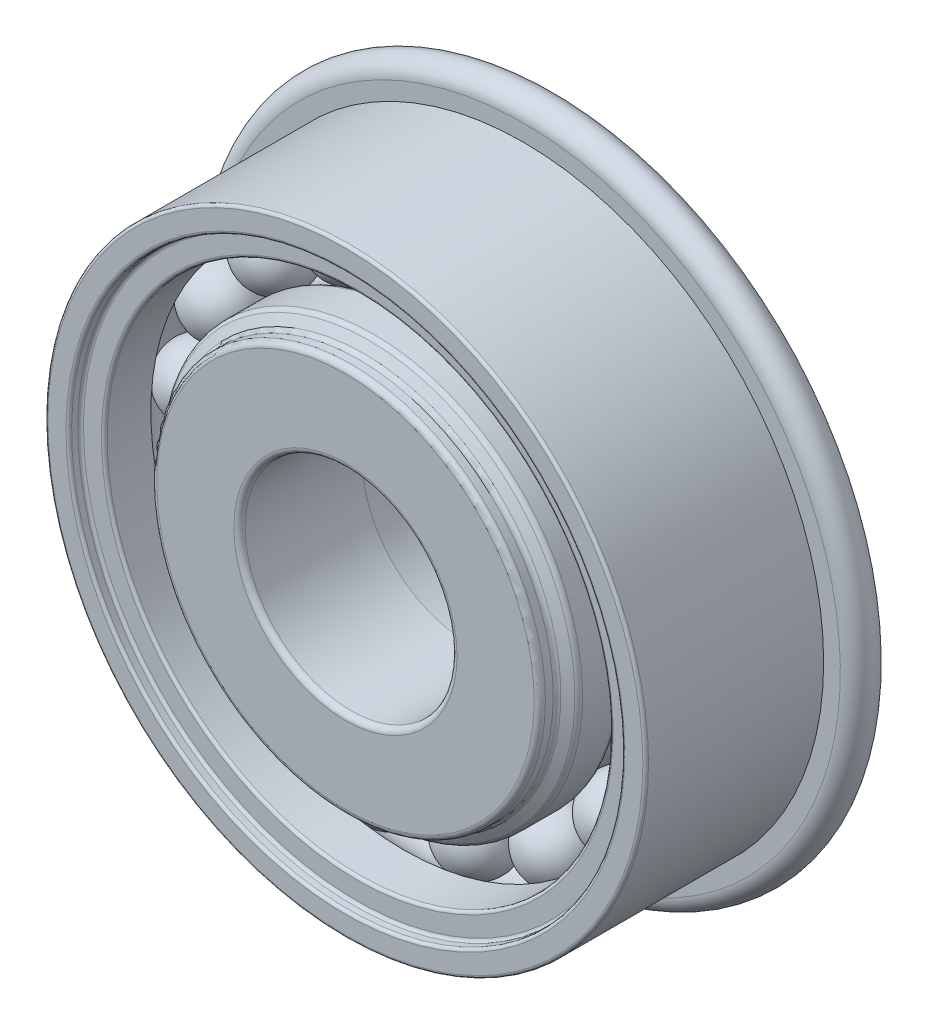
ISO-10303-21;
HEADER;
FILE_DESCRIPTION(('STEP AP214'),'2;1');
FILE_NAME('part.step','',(''),(''),'','','');
FILE_SCHEMA(('AUTOMOTIVE_DESIGN { 1 0 10303 214 1 1 1 1 }'));
ENDSEC;
DATA;
#1=APPLICATION_CONTEXT('core data for automotive mechanical design processes');
#2=APPLICATION_PROTOCOL_DEFINITION('international standard','automotive_design',2000,#1);
#3=PRODUCT_CONTEXT('',#1,'mechanical');
#4=PRODUCT('Part','Part','',(#3));
#5=PRODUCT_RELATED_PRODUCT_CATEGORY('part','',(#4));
#6=PRODUCT_DEFINITION_FORMATION('','',#4);
#7=PRODUCT_DEFINITION_CONTEXT('part definition',#1,'design');
#8=PRODUCT_DEFINITION('design','',#6,#7);
#9=PRODUCT_DEFINITION_SHAPE('','',#8);
#10=(LENGTH_UNIT() NAMED_UNIT(*) SI_UNIT(.MILLI.,.METRE.));
#11=(NAMED_UNIT(*) PLANE_ANGLE_UNIT() SI_UNIT($,.RADIAN.));
#12=(NAMED_UNIT(*) SI_UNIT($,.STERADIAN.) SOLID_ANGLE_UNIT());
#13=UNCERTAINTY_MEASURE_WITH_UNIT(LENGTH_MEASURE(1.E-05),#10,'distance_accuracy_value','');
#14=(GEOMETRIC_REPRESENTATION_CONTEXT(3) GLOBAL_UNCERTAINTY_ASSIGNED_CONTEXT((#13)) GLOBAL_UNIT_ASSIGNED_CONTEXT((#10,
#11,#12)) REPRESENTATION_CONTEXT('',''));
#15=CARTESIAN_POINT('',(0.,0.,0.));
#16=DIRECTION('',(0.,0.,1.));
#17=DIRECTION('',(1.,0.,0.));
#18=AXIS2_PLACEMENT_3D('',#15,#16,#17);
#19=CARTESIAN_POINT('',(-3.82161171076038,9.86471696209167,1.5621));
#20=DIRECTION('',(-0.361241666187141,0.932472229404361,0.));
#21=DIRECTION('',(0.,0.,-1.));
#22=AXIS2_PLACEMENT_3D('',#19,#20,#21);
#23=SPHERICAL_SURFACE('',#22,1.5875);
#24=CARTESIAN_POINT('',(-4.39508285583246,11.3450166262711,1.5621));
#25=VERTEX_POINT('',#24);
#26=VERTEX_LOOP('',#25);
#27=FACE_BOUND('',#26,.T.);
#28=ADVANCED_FACE('F46',(#27),#23,.T.);
#29=CLOSED_SHELL('',(#28));
#30=MANIFOLD_SOLID_BREP('B2',#29);
#31=CARTESIAN_POINT('',(-7.1270935837012,7.81804923616916,1.5621));
#32=DIRECTION('',(-0.673695643646548,0.739008917220668,0.));
#33=DIRECTION('',(0.,0.,-1.));
#34=AXIS2_PLACEMENT_3D('',#31,#32,#33);
#35=SPHERICAL_SURFACE('',#34,1.5875);
#36=CARTESIAN_POINT('',(-8.19658541799009,8.99122589225697,1.5621));
#37=VERTEX_POINT('',#36);
#38=VERTEX_LOOP('',#37);
#39=FACE_BOUND('',#38,.T.);
#40=ADVANCED_FACE('F65',(#39),#35,.T.);
#41=CLOSED_SHELL('',(#40));
#42=MANIFOLD_SOLID_BREP('B6',#41);
#43=CARTESIAN_POINT('',(-9.47002197557429,4.71551063959569,1.5621));
#44=DIRECTION('',(-0.895163291355057,0.445738355776549,0.));
#45=DIRECTION('',(0.,0.,-1.));
#46=AXIS2_PLACEMENT_3D('',#43,#44,#45);
#47=SPHERICAL_SURFACE('',#46,1.5875);
#48=CARTESIAN_POINT('',(-10.8910937006004,5.42312027939096,1.5621));
#49=VERTEX_POINT('',#48);
#50=VERTEX_LOOP('',#49);
#51=FACE_BOUND('',#50,.T.);
#52=ADVANCED_FACE('F84',(#51),#47,.T.);
#53=CLOSED_SHELL('',(#52));
#54=MANIFOLD_SOLID_BREP('B42',#53);
#55=CARTESIAN_POINT('',(-10.5339714244428,0.976116201598335,1.5621));
#56=DIRECTION('',(-0.995734176295033,0.092268359463313,0.));
#57=DIRECTION('',(0.,0.,-1.));
#58=AXIS2_PLACEMENT_3D('',#55,#56,#57);
#59=SPHERICAL_SURFACE('',#58,1.5875);
#60=CARTESIAN_POINT('',(-12.1146994293112,1.12259222224634,1.5621));
#61=VERTEX_POINT('',#60);
#62=VERTEX_LOOP('',#61);
#63=FACE_BOUND('',#62,.T.);
#64=ADVANCED_FACE('F103',(#63),#59,.T.);
#65=CLOSED_SHELL('',(#64));
#66=MANIFOLD_SOLID_BREP('B61',#65);
#67=CARTESIAN_POINT('',(-10.1752496616896,-2.89510813827147,1.5621));
#68=DIRECTION('',(-0.961825643172822,-0.273662990072073,0.));
#69=DIRECTION('',(0.,0.,-1.));
#70=AXIS2_PLACEMENT_3D('',#67,#68,#69);
#71=SPHERICAL_SURFACE('',#70,1.5875);
#72=CARTESIAN_POINT('',(-11.7021478702265,-3.32954813501088,1.5621));
#73=VERTEX_POINT('',#72);
#74=VERTEX_LOOP('',#73);
#75=FACE_BOUND('',#74,.T.);
#76=ADVANCED_FACE('F122',(#75),#71,.T.);
#77=CLOSED_SHELL('',(#76));
#78=MANIFOLD_SOLID_BREP('B80',#77);
#79=CARTESIAN_POINT('',(-8.44230404912044,-6.37533208171972,1.5621));
#80=DIRECTION('',(-0.798017227280245,-0.602634636379249,0.));
#81=DIRECTION('',(0.,0.,-1.));
#82=AXIS2_PLACEMENT_3D('',#79,#80,#81);
#83=SPHERICAL_SURFACE('',#82,1.5875);
#84=CARTESIAN_POINT('',(-9.70915639742782,-7.33201456697177,1.5621));
#85=VERTEX_POINT('',#84);
#86=VERTEX_LOOP('',#85);
#87=FACE_BOUND('',#86,.T.);
#88=ADVANCED_FACE('F141',(#87),#83,.T.);
#89=CLOSED_SHELL('',(#88));
#90=MANIFOLD_SOLID_BREP('B99',#89);
#91=CARTESIAN_POINT('',(-5.56917849429591,-8.99453210059712,1.5621));
#92=DIRECTION('',(-0.526432162877363,-0.85021713572961,0.));
#93=DIRECTION('',(0.,0.,-1.));
#94=AXIS2_PLACEMENT_3D('',#91,#92,#93);
#95=SPHERICAL_SURFACE('',#94,1.5875);
#96=CARTESIAN_POINT('',(-6.40488955286372,-10.3442518035679,1.5621));
#97=VERTEX_POINT('',#96);
#98=VERTEX_LOOP('',#97);
#99=FACE_BOUND('',#98,.T.);
#100=ADVANCED_FACE('F160',(#99),#95,.T.);
#101=CLOSED_SHELL('',(#100));
#102=MANIFOLD_SOLID_BREP('B118',#101);
#103=CARTESIAN_POINT('',(-1.94390452393336,-10.398970718866,1.5621));
#104=DIRECTION('',(-0.183749517816578,-0.9829730996839,0.));
#105=DIRECTION('',(0.,0.,-1.));
#106=AXIS2_PLACEMENT_3D('',#103,#104,#105);
#107=SPHERICAL_SURFACE('',#106,1.5875);
#108=CARTESIAN_POINT('',(-2.23560688346717,-11.9594405146141,1.5621));
#109=VERTEX_POINT('',#108);
#110=VERTEX_LOOP('',#109);
#111=FACE_BOUND('',#110,.T.);
#112=ADVANCED_FACE('F179',(#111),#107,.T.);
#113=CLOSED_SHELL('',(#112));
#114=MANIFOLD_SOLID_BREP('B137',#113);
#115=CARTESIAN_POINT('',(1.94390452393321,-10.398970718866,1.5621));
#116=DIRECTION('',(0.183749517816564,-0.982973099683903,0.));
#117=DIRECTION('',(0.,0.,-1.));
#118=AXIS2_PLACEMENT_3D('',#115,#116,#117);
#119=SPHERICAL_SURFACE('',#118,1.5875);
#120=CARTESIAN_POINT('',(2.235606883467,-11.9594405146142,1.5621));
#121=VERTEX_POINT('',#120);
#122=VERTEX_LOOP('',#121);
#123=FACE_BOUND('',#122,.T.);
#124=ADVANCED_FACE('F198',(#123),#119,.T.);
#125=CLOSED_SHELL('',(#124));
#126=MANIFOLD_SOLID_BREP('B156',#125);
#127=CARTESIAN_POINT('',(5.56917849429578,-8.9945321005972,1.5621));
#128=DIRECTION('',(0.526432162877351,-0.850217135729617,0.));
#129=DIRECTION('',(0.,0.,-1.));
#130=AXIS2_PLACEMENT_3D('',#127,#128,#129);
#131=SPHERICAL_SURFACE('',#130,1.5875);
#132=CARTESIAN_POINT('',(6.40488955286357,-10.344251803568,1.5621));
#133=VERTEX_POINT('',#132);
#134=VERTEX_LOOP('',#133);
#135=FACE_BOUND('',#134,.T.);
#136=ADVANCED_FACE('F217',(#135),#131,.T.);
#137=CLOSED_SHELL('',(#136));
#138=MANIFOLD_SOLID_BREP('B175',#137);
#139=CARTESIAN_POINT('',(8.44230404912035,-6.37533208171984,1.5621));
#140=DIRECTION('',(0.798017227280236,-0.602634636379261,0.));
#141=DIRECTION('',(0.,0.,-1.));
#142=AXIS2_PLACEMENT_3D('',#139,#140,#141);
#143=SPHERICAL_SURFACE('',#142,1.5875);
#144=CARTESIAN_POINT('',(9.70915639742772,-7.33201456697191,1.5621));
#145=VERTEX_POINT('',#144);
#146=VERTEX_LOOP('',#145);
#147=FACE_BOUND('',#146,.T.);
#148=ADVANCED_FACE('F236',(#147),#143,.T.);
#149=CLOSED_SHELL('',(#148));
#150=MANIFOLD_SOLID_BREP('B194',#149);
#151=CARTESIAN_POINT('',(10.1752496616896,-2.89510813827161,1.5621));
#152=DIRECTION('',(0.961825643172818,-0.273662990072087,0.));
#153=DIRECTION('',(0.,0.,-1.));
#154=AXIS2_PLACEMENT_3D('',#151,#152,#153);
#155=SPHERICAL_SURFACE('',#154,1.5875);
#156=CARTESIAN_POINT('',(11.7021478702264,-3.32954813501105,1.5621));
#157=VERTEX_POINT('',#156);
#158=VERTEX_LOOP('',#157);
#159=FACE_BOUND('',#158,.T.);
#160=ADVANCED_FACE('F255',(#159),#155,.T.);
#161=CLOSED_SHELL('',(#160));
#162=MANIFOLD_SOLID_BREP('B213',#161);
#163=CARTESIAN_POINT('',(10.5339714244428,0.976116201598183,1.5621));
#164=DIRECTION('',(0.995734176295035,0.0922683594632987,0.));
#165=DIRECTION('',(0.,0.,-1.));
#166=AXIS2_PLACEMENT_3D('',#163,#164,#165);
#167=SPHERICAL_SURFACE('',#166,1.5875);
#168=CARTESIAN_POINT('',(12.1146994293112,1.12259222224617,1.5621));
#169=VERTEX_POINT('',#168);
#170=VERTEX_LOOP('',#169);
#171=FACE_BOUND('',#170,.T.);
#172=ADVANCED_FACE('F274',(#171),#167,.T.);
#173=CLOSED_SHELL('',(#172));
#174=MANIFOLD_SOLID_BREP('B232',#173);
#175=CARTESIAN_POINT('',(9.47002197557435,4.71551063959555,1.5621));
#176=DIRECTION('',(0.895163291355063,0.445738355776536,0.));
#177=DIRECTION('',(0.,0.,-1.));
#178=AXIS2_PLACEMENT_3D('',#175,#176,#177);
#179=SPHERICAL_SURFACE('',#178,1.5875);
#180=CARTESIAN_POINT('',(10.8910937006005,5.4231202793908,1.5621));
#181=VERTEX_POINT('',#180);
#182=VERTEX_LOOP('',#181);
#183=FACE_BOUND('',#182,.T.);
#184=ADVANCED_FACE('F293',(#183),#179,.T.);
#185=CLOSED_SHELL('',(#184));
#186=MANIFOLD_SOLID_BREP('B251',#185);
#187=CARTESIAN_POINT('',(7.12709358370131,7.81804923616906,1.5621));
#188=DIRECTION('',(0.673695643646558,0.739008917220658,0.));
#189=DIRECTION('',(0.,0.,-1.));
#190=AXIS2_PLACEMENT_3D('',#187,#188,#189);
#191=SPHERICAL_SURFACE('',#190,1.5875);
#192=CARTESIAN_POINT('',(8.19658541799021,8.99122589225686,1.5621));
#193=VERTEX_POINT('',#192);
#194=VERTEX_LOOP('',#193);
#195=FACE_BOUND('',#194,.T.);
#196=ADVANCED_FACE('F312',(#195),#191,.T.);
#197=CLOSED_SHELL('',(#196));
#198=MANIFOLD_SOLID_BREP('B270',#197);
#199=CARTESIAN_POINT('',(3.82161171076052,9.86471696209162,1.5621));
#200=DIRECTION('',(0.361241666187154,0.932472229404355,0.));
#201=DIRECTION('',(0.,0.,-1.));
#202=AXIS2_PLACEMENT_3D('',#199,#200,#201);
#203=SPHERICAL_SURFACE('',#202,1.5875);
#204=CARTESIAN_POINT('',(4.39508285583262,11.345016626271,1.5621));
#205=VERTEX_POINT('',#204);
#206=VERTEX_LOOP('',#205);
#207=FACE_BOUND('',#206,.T.);
#208=ADVANCED_FACE('F331',(#207),#203,.T.);
#209=CLOSED_SHELL('',(#208));
#210=MANIFOLD_SOLID_BREP('B289',#209);
#211=CARTESIAN_POINT('',(0.,10.5791,1.5621));
#212=DIRECTION('',(0.,1.,0.));
#213=DIRECTION('',(0.,0.,-1.));
#214=AXIS2_PLACEMENT_3D('',#211,#212,#213);
#215=SPHERICAL_SURFACE('',#214,1.5875);
#216=CARTESIAN_POINT('',(0.,12.1666,1.5621));
#217=VERTEX_POINT('',#216);
#218=VERTEX_LOOP('',#217);
#219=FACE_BOUND('',#218,.T.);
#220=ADVANCED_FACE('F352',(#219),#215,.T.);
#221=CLOSED_SHELL('',(#220));
#222=MANIFOLD_SOLID_BREP('B308',#221);
#223=CARTESIAN_POINT('',(0.,8.7376,-5.5626));
#224=DIRECTION('',(0.,0.,1.));
#225=DIRECTION('',(0.,-1.,0.));
#226=AXIS2_PLACEMENT_3D('',#223,#224,#225);
#227=PLANE('',#226);
#228=CARTESIAN_POINT('',(0.,0.,-5.5626));
#229=DIRECTION('',(0.,0.,1.));
#230=DIRECTION('',(0.,-1.,0.));
#231=AXIS2_PLACEMENT_3D('',#228,#229,#230);
#232=CIRCLE('',#231,7.489825);
#233=CARTESIAN_POINT('',(0.,-7.489825,-5.5626));
#234=VERTEX_POINT('',#233);
#235=EDGE_CURVE('E351',#234,#234,#232,.F.);
#236=ORIENTED_EDGE('',*,*,#235,.T.);
#237=EDGE_LOOP('',(#236));
#238=FACE_BOUND('',#237,.T.);
#239=CARTESIAN_POINT('',(0.,0.,-5.5626));
#240=DIRECTION('',(0.,0.,1.));
#241=DIRECTION('',(0.,-1.,0.));
#242=AXIS2_PLACEMENT_3D('',#239,#240,#241);
#243=CIRCLE('',#242,6.50712885926724);
#244=CARTESIAN_POINT('',(0.,-6.50712885926724,-5.5626));
#245=VERTEX_POINT('',#244);
#246=EDGE_CURVE('E454',#245,#245,#243,.T.);
#247=ORIENTED_EDGE('',*,*,#246,.T.);
#248=EDGE_LOOP('',(#247));
#249=FACE_BOUND('',#248,.T.);
#250=ADVANCED_FACE('F372',(#238,#249),#227,.F.);
#251=CARTESIAN_POINT('',(0.,0.,5.5626));
#252=DIRECTION('',(0.,0.,1.));
#253=DIRECTION('',(0.,-1.,0.));
#254=AXIS2_PLACEMENT_3D('',#251,#252,#253);
#255=CYLINDRICAL_SURFACE('',#254,8.7376);
#256=CARTESIAN_POINT('',(0.,0.,-4.97734166666667));
#257=DIRECTION('',(0.,0.,-1.));
#258=DIRECTION('',(0.,1.,0.));
#259=AXIS2_PLACEMENT_3D('',#256,#257,#258);
#260=CIRCLE('',#259,8.7376);
#261=CARTESIAN_POINT('',(0.,8.7376,-4.97734166666667));
#262=VERTEX_POINT('',#261);
#263=EDGE_CURVE('E446',#262,#262,#260,.F.);
#264=ORIENTED_EDGE('',*,*,#263,.T.);
#265=EDGE_LOOP('',(#264));
#266=FACE_BOUND('',#265,.T.);
#267=CARTESIAN_POINT('',(0.,0.,-2.58504696837417));
#268=DIRECTION('',(0.,0.,1.));
#269=DIRECTION('',(0.,-1.,0.));
#270=AXIS2_PLACEMENT_3D('',#267,#268,#269);
#271=CIRCLE('',#270,8.7376);
#272=CARTESIAN_POINT('',(0.,-8.7376,-2.58504696837417));
#273=VERTEX_POINT('',#272);
#274=EDGE_CURVE('E450',#273,#273,#271,.F.);
#275=ORIENTED_EDGE('',*,*,#274,.T.);
#276=EDGE_LOOP('',(#275));
#277=FACE_BOUND('',#276,.T.);
#278=ADVANCED_FACE('F522',(#266,#277),#255,.T.);
#279=CARTESIAN_POINT('',(0.,0.,5.5626));
#280=DIRECTION('',(0.,0.,1.));
#281=DIRECTION('',(0.,-1.,0.));
#282=AXIS2_PLACEMENT_3D('',#279,#280,#281);
#283=CYLINDRICAL_SURFACE('',#282,4.7625);
#284=CARTESIAN_POINT('',(0.,0.,5.3086));
#285=DIRECTION('',(0.,0.,-1.));
#286=DIRECTION('',(0.,1.,0.));
#287=AXIS2_PLACEMENT_3D('',#284,#285,#286);
#288=CIRCLE('',#287,4.7625);
#289=CARTESIAN_POINT('',(0.,4.7625,5.3086));
#290=VERTEX_POINT('',#289);
#291=EDGE_CURVE('E386',#290,#290,#288,.F.);
#292=ORIENTED_EDGE('',*,*,#291,.T.);
#293=EDGE_LOOP('',(#292));
#294=FACE_BOUND('',#293,.T.);
#295=CARTESIAN_POINT('',(0.,0.,0.0436024131329473));
#296=DIRECTION('',(0.,0.,1.));
#297=DIRECTION('',(0.,-1.,0.));
#298=AXIS2_PLACEMENT_3D('',#295,#296,#297);
#299=CIRCLE('',#298,4.7625);
#300=CARTESIAN_POINT('',(0.,-4.7625,0.0436024131329465));
#301=VERTEX_POINT('',#300);
#302=EDGE_CURVE('E462',#301,#301,#299,.T.);
#303=ORIENTED_EDGE('',*,*,#302,.F.);
#304=EDGE_LOOP('',(#303));
#305=FACE_BOUND('',#304,.T.);
#306=ADVANCED_FACE('F527',(#294,#305),#283,.F.);
#307=CARTESIAN_POINT('',(0.,4.7625,5.5626));
#308=DIRECTION('',(0.,0.,-1.));
#309=DIRECTION('',(0.,1.,0.));
#310=AXIS2_PLACEMENT_3D('',#307,#308,#309);
#311=PLANE('',#310);
#312=CARTESIAN_POINT('',(0.,0.,5.5626));
#313=DIRECTION('',(0.,0.,-1.));
#314=DIRECTION('',(0.,1.,0.));
#315=AXIS2_PLACEMENT_3D('',#312,#313,#314);
#316=CIRCLE('',#315,8.4836);
#317=CARTESIAN_POINT('',(0.,8.4836,5.5626));
#318=VERTEX_POINT('',#317);
#319=EDGE_CURVE('E392',#318,#318,#316,.F.);
#320=ORIENTED_EDGE('',*,*,#319,.T.);
#321=EDGE_LOOP('',(#320));
#322=FACE_BOUND('',#321,.T.);
#323=CARTESIAN_POINT('',(0.,0.,5.5626));
#324=DIRECTION('',(0.,0.,-1.));
#325=DIRECTION('',(0.,1.,0.));
#326=AXIS2_PLACEMENT_3D('',#323,#324,#325);
#327=CIRCLE('',#326,5.0165);
#328=CARTESIAN_POINT('',(0.,5.0165,5.5626));
#329=VERTEX_POINT('',#328);
#330=EDGE_CURVE('E398',#329,#329,#327,.T.);
#331=ORIENTED_EDGE('',*,*,#330,.T.);
#332=EDGE_LOOP('',(#331));
#333=FACE_BOUND('',#332,.T.);
#334=ADVANCED_FACE('F535',(#322,#333),#311,.F.);
#335=CARTESIAN_POINT('',(0.,0.,-2.4384));
#336=DIRECTION('',(0.,0.,1.));
#337=DIRECTION('',(0.,-1.,0.));
#338=AXIS2_PLACEMENT_3D('',#335,#336,#337);
#339=CONICAL_SURFACE('',#338,8.7376,1.0471975511966);
#340=CARTESIAN_POINT('',(0.,0.,-2.36507651581292));
#341=DIRECTION('',(0.,0.,1.));
#342=DIRECTION('',(0.,-1.,0.));
#343=AXIS2_PLACEMENT_3D('',#340,#341,#342);
#344=CIRCLE('',#343,8.8646);
#345=CARTESIAN_POINT('',(0.,-8.8646,-2.36507651581292));
#346=VERTEX_POINT('',#345);
#347=EDGE_CURVE('E438',#346,#346,#344,.T.);
#348=ORIENTED_EDGE('',*,*,#347,.T.);
#349=EDGE_LOOP('',(#348));
#350=FACE_BOUND('',#349,.T.);
#351=CARTESIAN_POINT('',(0.,0.,-2.06261714354121));
#352=DIRECTION('',(0.,0.,1.));
#353=DIRECTION('',(0.,-1.,0.));
#354=AXIS2_PLACEMENT_3D('',#351,#352,#353);
#355=CIRCLE('',#354,9.388475);
#356=CARTESIAN_POINT('',(0.,-9.388475,-2.06261714354121));
#357=VERTEX_POINT('',#356);
#358=EDGE_CURVE('E458',#357,#357,#355,.T.);
#359=ORIENTED_EDGE('',*,*,#358,.F.);
#360=EDGE_LOOP('',(#359));
#361=FACE_BOUND('',#360,.T.);
#362=ADVANCED_FACE('F538',(#350,#361),#339,.T.);
#363=CARTESIAN_POINT('',(0.,0.,5.5626));
#364=DIRECTION('',(0.,0.,1.));
#365=DIRECTION('',(0.,-1.,0.));
#366=AXIS2_PLACEMENT_3D('',#363,#364,#365);
#367=CYLINDRICAL_SURFACE('',#366,9.388475);
#368=CARTESIAN_POINT('',(0.,0.,0.420092618511163));
#369=DIRECTION('',(0.,0.,-1.));
#370=DIRECTION('',(0.,1.,0.));
#371=AXIS2_PLACEMENT_3D('',#368,#369,#370);
#372=CIRCLE('',#371,9.388475);
#373=CARTESIAN_POINT('',(0.,9.388475,0.420092618511165));
#374=VERTEX_POINT('',#373);
#375=EDGE_CURVE('E426',#374,#374,#372,.T.);
#376=ORIENTED_EDGE('',*,*,#375,.T.);
#377=EDGE_LOOP('',(#376));
#378=FACE_BOUND('',#377,.T.);
#379=ORIENTED_EDGE('',*,*,#358,.T.);
#380=EDGE_LOOP('',(#379));
#381=FACE_BOUND('',#380,.T.);
#382=ADVANCED_FACE('F645',(#378,#381),#367,.T.);
#383=CARTESIAN_POINT('',(0.,0.,1.5621));
#384=DIRECTION('',(0.,0.,1.));
#385=DIRECTION('',(0.,-1.,0.));
#386=AXIS2_PLACEMENT_3D('',#383,#384,#385);
#387=TOROIDAL_SURFACE('',#386,10.5791,1.5875);
#388=CARTESIAN_POINT('',(0.,0.,0.577610878026869));
#389=DIRECTION('',(0.,0.,1.));
#390=DIRECTION('',(0.,-1.,0.));
#391=AXIS2_PLACEMENT_3D('',#388,#389,#390);
#392=CIRCLE('',#391,9.33373362068966);
#393=CARTESIAN_POINT('',(0.,-9.33373362068966,0.577610878026868));
#394=VERTEX_POINT('',#393);
#395=EDGE_CURVE('E430',#394,#394,#392,.T.);
#396=ORIENTED_EDGE('',*,*,#395,.T.);
#397=EDGE_LOOP('',(#396));
#398=FACE_BOUND('',#397,.T.);
#399=CARTESIAN_POINT('',(0.,0.,2.54658912197313));
#400=DIRECTION('',(0.,0.,-1.));
#401=DIRECTION('',(0.,1.,0.));
#402=AXIS2_PLACEMENT_3D('',#399,#400,#401);
#403=CIRCLE('',#402,9.33373362068966);
#404=CARTESIAN_POINT('',(0.,9.33373362068966,2.54658912197313));
#405=VERTEX_POINT('',#404);
#406=EDGE_CURVE('E434',#405,#405,#403,.T.);
#407=ORIENTED_EDGE('',*,*,#406,.T.);
#408=EDGE_LOOP('',(#407));
#409=FACE_BOUND('',#408,.T.);
#410=ADVANCED_FACE('F641',(#398,#409),#387,.F.);
#411=CARTESIAN_POINT('',(0.,0.,5.5626));
#412=DIRECTION('',(0.,0.,1.));
#413=DIRECTION('',(0.,-1.,0.));
#414=AXIS2_PLACEMENT_3D('',#411,#412,#413);
#415=CYLINDRICAL_SURFACE('',#414,9.388475);
#416=CARTESIAN_POINT('',(0.,0.,2.70410738148883));
#417=DIRECTION('',(0.,0.,-1.));
#418=DIRECTION('',(0.,1.,0.));
#419=AXIS2_PLACEMENT_3D('',#416,#417,#418);
#420=CIRCLE('',#419,9.388475);
#421=CARTESIAN_POINT('',(0.,9.388475,2.70410738148884));
#422=VERTEX_POINT('',#421);
#423=EDGE_CURVE('E418',#422,#422,#420,.F.);
#424=ORIENTED_EDGE('',*,*,#423,.T.);
#425=EDGE_LOOP('',(#424));
#426=FACE_BOUND('',#425,.T.);
#427=CARTESIAN_POINT('',(0.,0.,4.28860446224945));
#428=DIRECTION('',(0.,0.,-1.));
#429=DIRECTION('',(0.,1.,0.));
#430=AXIS2_PLACEMENT_3D('',#427,#428,#429);
#431=CIRCLE('',#430,9.388475);
#432=CARTESIAN_POINT('',(0.,9.388475,4.28860446224945));
#433=VERTEX_POINT('',#432);
#434=EDGE_CURVE('E422',#433,#433,#431,.T.);
#435=ORIENTED_EDGE('',*,*,#434,.T.);
#436=EDGE_LOOP('',(#435));
#437=FACE_BOUND('',#436,.T.);
#438=ADVANCED_FACE('F637',(#426,#437),#415,.T.);
#439=CARTESIAN_POINT('',(0.,0.,4.43525143062361));
#440=DIRECTION('',(0.,0.,-1.));
#441=DIRECTION('',(0.,1.,0.));
#442=AXIS2_PLACEMENT_3D('',#439,#440,#441);
#443=CONICAL_SURFACE('',#442,9.388475,1.0471975511966);
#444=CARTESIAN_POINT('',(0.,0.,4.50857491481069));
#445=DIRECTION('',(0.,0.,1.));
#446=DIRECTION('',(0.,-1.,0.));
#447=AXIS2_PLACEMENT_3D('',#444,#445,#446);
#448=CIRCLE('',#447,9.261475);
#449=CARTESIAN_POINT('',(0.,-9.261475,4.50857491481069));
#450=VERTEX_POINT('',#449);
#451=EDGE_CURVE('E410',#450,#450,#448,.T.);
#452=ORIENTED_EDGE('',*,*,#451,.T.);
#453=EDGE_LOOP('',(#452));
#454=FACE_BOUND('',#453,.T.);
#455=CARTESIAN_POINT('',(0.,0.,4.73771080289532));
#456=DIRECTION('',(0.,0.,-1.));
#457=DIRECTION('',(0.,1.,0.));
#458=AXIS2_PLACEMENT_3D('',#455,#456,#457);
#459=CIRCLE('',#458,8.8646);
#460=CARTESIAN_POINT('',(0.,8.8646,4.73771080289532));
#461=VERTEX_POINT('',#460);
#462=EDGE_CURVE('E414',#461,#461,#459,.T.);
#463=ORIENTED_EDGE('',*,*,#462,.T.);
#464=EDGE_LOOP('',(#463));
#465=FACE_BOUND('',#464,.T.);
#466=ADVANCED_FACE('F633',(#454,#465),#443,.T.);
#467=CARTESIAN_POINT('',(0.,0.,5.5626));
#468=DIRECTION('',(0.,0.,1.));
#469=DIRECTION('',(0.,-1.,0.));
#470=AXIS2_PLACEMENT_3D('',#467,#468,#469);
#471=CYLINDRICAL_SURFACE('',#470,8.7376);
#472=CARTESIAN_POINT('',(0.,0.,4.95768125545657));
#473=DIRECTION('',(0.,0.,1.));
#474=DIRECTION('',(0.,-1.,0.));
#475=AXIS2_PLACEMENT_3D('',#472,#473,#474);
#476=CIRCLE('',#475,8.7376);
#477=CARTESIAN_POINT('',(0.,-8.7376,4.95768125545657));
#478=VERTEX_POINT('',#477);
#479=EDGE_CURVE('E402',#478,#478,#476,.T.);
#480=ORIENTED_EDGE('',*,*,#479,.T.);
#481=EDGE_LOOP('',(#480));
#482=FACE_BOUND('',#481,.T.);
#483=CARTESIAN_POINT('',(0.,0.,5.3086));
#484=DIRECTION('',(0.,0.,-1.));
#485=DIRECTION('',(0.,1.,0.));
#486=AXIS2_PLACEMENT_3D('',#483,#484,#485);
#487=CIRCLE('',#486,8.7376);
#488=CARTESIAN_POINT('',(0.,8.7376,5.3086));
#489=VERTEX_POINT('',#488);
#490=EDGE_CURVE('E406',#489,#489,#487,.T.);
#491=ORIENTED_EDGE('',*,*,#490,.T.);
#492=EDGE_LOOP('',(#491));
#493=FACE_BOUND('',#492,.T.);
#494=ADVANCED_FACE('F590',(#482,#493),#471,.T.);
#495=CARTESIAN_POINT('',(0.,0.,-4.82656452036773));
#496=DIRECTION('',(0.,0.,1.));
#497=DIRECTION('',(0.,-1.,0.));
#498=AXIS2_PLACEMENT_3D('',#495,#496,#497);
#499=TOROIDAL_SURFACE('',#498,5.95349511236812,0.762);
#500=CARTESIAN_POINT('',(0.,0.,-4.89297719634144));
#501=DIRECTION('',(0.,0.,1.));
#502=DIRECTION('',(0.,-1.,0.));
#503=AXIS2_PLACEMENT_3D('',#500,#501,#502);
#504=CIRCLE('',#503,5.19439475242221);
#505=CARTESIAN_POINT('',(0.,-5.19439475242221,-4.89297719634144));
#506=VERTEX_POINT('',#505);
#507=EDGE_CURVE('E466',#506,#506,#504,.T.);
#508=ORIENTED_EDGE('',*,*,#507,.T.);
#509=EDGE_LOOP('',(#508));
#510=FACE_BOUND('',#509,.T.);
#511=CARTESIAN_POINT('',(0.,0.,-5.5626));
#512=DIRECTION('',(0.,0.,1.));
#513=DIRECTION('',(0.,-1.,0.));
#514=AXIS2_PLACEMENT_3D('',#511,#512,#513);
#515=CIRCLE('',#514,5.756275);
#516=CARTESIAN_POINT('',(0.,-5.756275,-5.5626));
#517=VERTEX_POINT('',#516);
#518=EDGE_CURVE('E490',#517,#517,#515,.T.);
#519=ORIENTED_EDGE('',*,*,#518,.F.);
#520=EDGE_LOOP('',(#519));
#521=FACE_BOUND('',#520,.T.);
#522=ADVANCED_FACE('F584',(#510,#521),#499,.T.);
#523=CARTESIAN_POINT('',(0.,0.,-4.89297719634144));
#524=DIRECTION('',(0.,0.,-1.));
#525=DIRECTION('',(0.,1.,0.));
#526=AXIS2_PLACEMENT_3D('',#523,#524,#525);
#527=CONICAL_SURFACE('',#526,5.19439475242221,0.0872664625997097);
#528=ORIENTED_EDGE('',*,*,#302,.T.);
#529=EDGE_LOOP('',(#528));
#530=FACE_BOUND('',#529,.T.);
#531=ORIENTED_EDGE('',*,*,#507,.F.);
#532=EDGE_LOOP('',(#531));
#533=FACE_BOUND('',#532,.T.);
#534=ADVANCED_FACE('F580',(#530,#533),#527,.F.);
#535=CARTESIAN_POINT('',(0.,0.,-4.82656452036773));
#536=DIRECTION('',(0.,0.,1.));
#537=DIRECTION('',(0.,-1.,0.));
#538=AXIS2_PLACEMENT_3D('',#535,#536,#537);
#539=TOROIDAL_SURFACE('',#538,5.95349511236812,0.508000000000001);
#540=CARTESIAN_POINT('',(0.,0.,-5.31725484012258));
#541=DIRECTION('',(0.,0.,1.));
#542=DIRECTION('',(0.,-1.,0.));
#543=AXIS2_PLACEMENT_3D('',#540,#541,#542);
#544=CIRCLE('',#543,5.82201503745604);
#545=CARTESIAN_POINT('',(0.,-5.82201503745604,-5.31725484012258));
#546=VERTEX_POINT('',#545);
#547=EDGE_CURVE('E494',#546,#546,#544,.T.);
#548=ORIENTED_EDGE('',*,*,#547,.T.);
#549=EDGE_LOOP('',(#548));
#550=FACE_BOUND('',#549,.T.);
#551=CARTESIAN_POINT('',(0.,0.,-4.87083963768354));
#552=DIRECTION('',(0.,0.,1.));
#553=DIRECTION('',(0.,-1.,0.));
#554=AXIS2_PLACEMENT_3D('',#551,#552,#553);
#555=CIRCLE('',#554,5.44742820573751);
#556=CARTESIAN_POINT('',(0.,-5.44742820573751,-4.87083963768354));
#557=VERTEX_POINT('',#556);
#558=EDGE_CURVE('E470',#557,#557,#555,.T.);
#559=ORIENTED_EDGE('',*,*,#558,.F.);
#560=EDGE_LOOP('',(#559));
#561=FACE_BOUND('',#560,.T.);
#562=ADVANCED_FACE('F583',(#550,#561),#539,.F.);
#563=CARTESIAN_POINT('',(0.,0.,-3.9624));
#564=DIRECTION('',(0.,0.,-1.));
#565=DIRECTION('',(0.,1.,0.));
#566=AXIS2_PLACEMENT_3D('',#563,#564,#565);
#567=CONICAL_SURFACE('',#566,5.36795003594261,0.0872664625997097);
#568=ORIENTED_EDGE('',*,*,#558,.T.);
#569=EDGE_LOOP('',(#568));
#570=FACE_BOUND('',#569,.T.);
#571=CARTESIAN_POINT('',(0.,0.,-3.9624));
#572=DIRECTION('',(0.,0.,1.));
#573=DIRECTION('',(0.,-1.,0.));
#574=AXIS2_PLACEMENT_3D('',#571,#572,#573);
#575=CIRCLE('',#574,5.36795003594261);
#576=CARTESIAN_POINT('',(0.,-5.36795003594261,-3.9624));
#577=VERTEX_POINT('',#576);
#578=EDGE_CURVE('E474',#577,#577,#575,.T.);
#579=ORIENTED_EDGE('',*,*,#578,.F.);
#580=EDGE_LOOP('',(#579));
#581=FACE_BOUND('',#580,.T.);
#582=ADVANCED_FACE('F601',(#570,#581),#567,.T.);
#583=CARTESIAN_POINT('',(0.,5.36795003594261,-3.9624));
#584=DIRECTION('',(0.,0.,-1.));
#585=DIRECTION('',(0.,1.,0.));
#586=AXIS2_PLACEMENT_3D('',#583,#584,#585);
#587=PLANE('',#586);
#588=ORIENTED_EDGE('',*,*,#578,.T.);
#589=EDGE_LOOP('',(#588));
#590=FACE_BOUND('',#589,.T.);
#591=CARTESIAN_POINT('',(0.,0.,-3.9624));
#592=DIRECTION('',(0.,0.,1.));
#593=DIRECTION('',(0.,-1.,0.));
#594=AXIS2_PLACEMENT_3D('',#591,#592,#593);
#595=CIRCLE('',#594,5.49543515531062);
#596=CARTESIAN_POINT('',(0.,-5.49543515531061,-3.9624));
#597=VERTEX_POINT('',#596);
#598=EDGE_CURVE('E478',#597,#597,#595,.T.);
#599=ORIENTED_EDGE('',*,*,#598,.F.);
#600=EDGE_LOOP('',(#599));
#601=FACE_BOUND('',#600,.T.);
#602=ADVANCED_FACE('F607',(#590,#601),#587,.T.);
#603=CARTESIAN_POINT('',(0.,0.,-4.85977085835459));
#604=DIRECTION('',(0.,0.,-1.));
#605=DIRECTION('',(0.,1.,0.));
#606=AXIS2_PLACEMENT_3D('',#603,#604,#605);
#607=CONICAL_SURFACE('',#606,5.57394493239517,0.0872664625997105);
#608=ORIENTED_EDGE('',*,*,#598,.T.);
#609=EDGE_LOOP('',(#608));
#610=FACE_BOUND('',#609,.T.);
#611=CARTESIAN_POINT('',(0.,0.,-4.85977085835459));
#612=DIRECTION('',(0.,0.,1.));
#613=DIRECTION('',(0.,-1.,0.));
#614=AXIS2_PLACEMENT_3D('',#611,#612,#613);
#615=CIRCLE('',#614,5.57394493239517);
#616=CARTESIAN_POINT('',(0.,-5.57394493239516,-4.85977085835459));
#617=VERTEX_POINT('',#616);
#618=EDGE_CURVE('E482',#617,#617,#615,.T.);
#619=ORIENTED_EDGE('',*,*,#618,.F.);
#620=EDGE_LOOP('',(#619));
#621=FACE_BOUND('',#620,.T.);
#622=ADVANCED_FACE('F613',(#610,#621),#607,.F.);
#623=CARTESIAN_POINT('',(0.,0.,-4.82656452036773));
#624=DIRECTION('',(0.,0.,1.));
#625=DIRECTION('',(0.,-1.,0.));
#626=AXIS2_PLACEMENT_3D('',#623,#624,#625);
#627=TOROIDAL_SURFACE('',#626,5.95349511236812,0.381);
#628=ORIENTED_EDGE('',*,*,#618,.T.);
#629=EDGE_LOOP('',(#628));
#630=FACE_BOUND('',#629,.T.);
#631=CARTESIAN_POINT('',(0.,0.,-5.19458226018387));
#632=DIRECTION('',(0.,0.,1.));
#633=DIRECTION('',(0.,-1.,0.));
#634=AXIS2_PLACEMENT_3D('',#631,#632,#633);
#635=CIRCLE('',#634,5.85488505618406);
#636=CARTESIAN_POINT('',(0.,-5.85488505618406,-5.19458226018387));
#637=VERTEX_POINT('',#636);
#638=EDGE_CURVE('E486',#637,#637,#635,.T.);
#639=ORIENTED_EDGE('',*,*,#638,.F.);
#640=EDGE_LOOP('',(#639));
#641=FACE_BOUND('',#640,.T.);
#642=ADVANCED_FACE('F596',(#630,#641),#627,.T.);
#643=CARTESIAN_POINT('',(0.,0.,-5.31725484012258));
#644=DIRECTION('',(0.,0.,1.));
#645=DIRECTION('',(0.,-1.,0.));
#646=AXIS2_PLACEMENT_3D('',#643,#644,#645);
#647=CONICAL_SURFACE('',#646,5.82201503745604,0.261799387799143);
#648=ORIENTED_EDGE('',*,*,#518,.T.);
#649=EDGE_LOOP('',(#648));
#650=FACE_BOUND('',#649,.T.);
#651=ORIENTED_EDGE('',*,*,#547,.F.);
#652=EDGE_LOOP('',(#651));
#653=FACE_BOUND('',#652,.T.);
#654=ADVANCED_FACE('F517',(#650,#653),#647,.T.);
#655=CARTESIAN_POINT('',(0.,0.,-4.8006));
#656=DIRECTION('',(0.,0.,1.));
#657=DIRECTION('',(0.,-1.,0.));
#658=AXIS2_PLACEMENT_3D('',#655,#656,#657);
#659=TOROIDAL_SURFACE('',#658,6.50712885926724,0.762);
#660=ORIENTED_EDGE('',*,*,#638,.T.);
#661=EDGE_LOOP('',(#660));
#662=FACE_BOUND('',#661,.T.);
#663=ORIENTED_EDGE('',*,*,#246,.F.);
#664=EDGE_LOOP('',(#663));
#665=FACE_BOUND('',#664,.T.);
#666=ADVANCED_FACE('F508',(#662,#665),#659,.T.);
#667=CARTESIAN_POINT('',(0.,0.,5.5626));
#668=DIRECTION('',(0.,0.,1.));
#669=DIRECTION('',(0.,-1.,0.));
#670=AXIS2_PLACEMENT_3D('',#667,#668,#669);
#671=CYLINDRICAL_SURFACE('',#670,7.743825);
#672=CARTESIAN_POINT('',(0.,0.,-5.3086));
#673=DIRECTION('',(0.,0.,1.));
#674=DIRECTION('',(0.,-1.,0.));
#675=AXIS2_PLACEMENT_3D('',#672,#673,#674);
#676=CIRCLE('',#675,7.743825);
#677=CARTESIAN_POINT('',(0.,-7.743825,-5.3086));
#678=VERTEX_POINT('',#677);
#679=EDGE_CURVE('E380',#678,#678,#676,.T.);
#680=ORIENTED_EDGE('',*,*,#679,.T.);
#681=EDGE_LOOP('',(#680));
#682=FACE_BOUND('',#681,.T.);
#683=CARTESIAN_POINT('',(0.,0.,-5.23134166666667));
#684=DIRECTION('',(0.,0.,1.));
#685=DIRECTION('',(0.,-1.,0.));
#686=AXIS2_PLACEMENT_3D('',#683,#684,#685);
#687=CIRCLE('',#686,7.743825);
#688=CARTESIAN_POINT('',(0.,-7.743825,-5.23134166666667));
#689=VERTEX_POINT('',#688);
#690=EDGE_CURVE('E498',#689,#689,#687,.T.);
#691=ORIENTED_EDGE('',*,*,#690,.F.);
#692=EDGE_LOOP('',(#691));
#693=FACE_BOUND('',#692,.T.);
#694=ADVANCED_FACE('F506',(#682,#693),#671,.T.);
#695=CARTESIAN_POINT('',(0.,8.07508333333333,-5.23134166666667));
#696=DIRECTION('',(0.,0.,-1.));
#697=DIRECTION('',(0.,1.,0.));
#698=AXIS2_PLACEMENT_3D('',#695,#696,#697);
#699=PLANE('',#698);
#700=CARTESIAN_POINT('',(0.,0.,-5.23134166666667));
#701=DIRECTION('',(0.,0.,-1.));
#702=DIRECTION('',(0.,1.,0.));
#703=AXIS2_PLACEMENT_3D('',#700,#701,#702);
#704=CIRCLE('',#703,8.4836);
#705=CARTESIAN_POINT('',(0.,8.4836,-5.23134166666667));
#706=VERTEX_POINT('',#705);
#707=EDGE_CURVE('E442',#706,#706,#704,.T.);
#708=ORIENTED_EDGE('',*,*,#707,.T.);
#709=EDGE_LOOP('',(#708));
#710=FACE_BOUND('',#709,.T.);
#711=ORIENTED_EDGE('',*,*,#690,.T.);
#712=EDGE_LOOP('',(#711));
#713=FACE_BOUND('',#712,.T.);
#714=ADVANCED_FACE('F504',(#710,#713),#699,.T.);
#715=CARTESIAN_POINT('',(0.,0.,-4.97734166666667));
#716=DIRECTION('',(0.,0.,-1.));
#717=DIRECTION('',(0.,1.,0.));
#718=AXIS2_PLACEMENT_3D('',#715,#716,#717);
#719=TOROIDAL_SURFACE('',#718,8.4836,0.254);
#720=ORIENTED_EDGE('',*,*,#707,.F.);
#721=EDGE_LOOP('',(#720));
#722=FACE_BOUND('',#721,.T.);
#723=ORIENTED_EDGE('',*,*,#263,.F.);
#724=EDGE_LOOP('',(#723));
#725=FACE_BOUND('',#724,.T.);
#726=ADVANCED_FACE('F514',(#722,#725),#719,.T.);
#727=CARTESIAN_POINT('',(0.,0.,-2.58504696837417));
#728=DIRECTION('',(0.,0.,1.));
#729=DIRECTION('',(0.,-1.,0.));
#730=AXIS2_PLACEMENT_3D('',#727,#728,#729);
#731=TOROIDAL_SURFACE('',#730,8.9916,0.254);
#732=ORIENTED_EDGE('',*,*,#274,.F.);
#733=EDGE_LOOP('',(#732));
#734=FACE_BOUND('',#733,.T.);
#735=ORIENTED_EDGE('',*,*,#347,.F.);
#736=EDGE_LOOP('',(#735));
#737=FACE_BOUND('',#736,.T.);
#738=ADVANCED_FACE('F543',(#734,#737),#731,.F.);
#739=CARTESIAN_POINT('',(0.,0.,0.420092618511163));
#740=DIRECTION('',(0.,0.,-1.));
#741=DIRECTION('',(0.,1.,0.));
#742=AXIS2_PLACEMENT_3D('',#739,#740,#741);
#743=TOROIDAL_SURFACE('',#742,9.134475,0.254);
#744=ORIENTED_EDGE('',*,*,#375,.F.);
#745=EDGE_LOOP('',(#744));
#746=FACE_BOUND('',#745,.T.);
#747=ORIENTED_EDGE('',*,*,#395,.F.);
#748=EDGE_LOOP('',(#747));
#749=FACE_BOUND('',#748,.T.);
#750=ADVANCED_FACE('F547',(#746,#749),#743,.T.);
#751=CARTESIAN_POINT('',(0.,0.,2.70410738148883));
#752=DIRECTION('',(0.,0.,-1.));
#753=DIRECTION('',(0.,1.,0.));
#754=AXIS2_PLACEMENT_3D('',#751,#752,#753);
#755=TOROIDAL_SURFACE('',#754,9.134475,0.254);
#756=ORIENTED_EDGE('',*,*,#406,.F.);
#757=EDGE_LOOP('',(#756));
#758=FACE_BOUND('',#757,.T.);
#759=ORIENTED_EDGE('',*,*,#423,.F.);
#760=EDGE_LOOP('',(#759));
#761=FACE_BOUND('',#760,.T.);
#762=ADVANCED_FACE('F551',(#758,#761),#755,.T.);
#763=CARTESIAN_POINT('',(0.,0.,4.28860446224945));
#764=DIRECTION('',(0.,0.,-1.));
#765=DIRECTION('',(0.,1.,0.));
#766=AXIS2_PLACEMENT_3D('',#763,#764,#765);
#767=TOROIDAL_SURFACE('',#766,9.134475,0.254);
#768=ORIENTED_EDGE('',*,*,#434,.F.);
#769=EDGE_LOOP('',(#768));
#770=FACE_BOUND('',#769,.T.);
#771=ORIENTED_EDGE('',*,*,#451,.F.);
#772=EDGE_LOOP('',(#771));
#773=FACE_BOUND('',#772,.T.);
#774=ADVANCED_FACE('F555',(#770,#773),#767,.T.);
#775=CARTESIAN_POINT('',(0.,0.,4.95768125545657));
#776=DIRECTION('',(0.,0.,1.));
#777=DIRECTION('',(0.,-1.,0.));
#778=AXIS2_PLACEMENT_3D('',#775,#776,#777);
#779=TOROIDAL_SURFACE('',#778,8.9916,0.254);
#780=ORIENTED_EDGE('',*,*,#462,.F.);
#781=EDGE_LOOP('',(#780));
#782=FACE_BOUND('',#781,.T.);
#783=ORIENTED_EDGE('',*,*,#479,.F.);
#784=EDGE_LOOP('',(#783));
#785=FACE_BOUND('',#784,.T.);
#786=ADVANCED_FACE('F559',(#782,#785),#779,.F.);
#787=CARTESIAN_POINT('',(0.,0.,5.3086));
#788=DIRECTION('',(0.,0.,-1.));
#789=DIRECTION('',(0.,1.,0.));
#790=AXIS2_PLACEMENT_3D('',#787,#788,#789);
#791=TOROIDAL_SURFACE('',#790,8.4836,0.254);
#792=ORIENTED_EDGE('',*,*,#490,.F.);
#793=EDGE_LOOP('',(#792));
#794=FACE_BOUND('',#793,.T.);
#795=ORIENTED_EDGE('',*,*,#319,.F.);
#796=EDGE_LOOP('',(#795));
#797=FACE_BOUND('',#796,.T.);
#798=ADVANCED_FACE('F563',(#794,#797),#791,.T.);
#799=CARTESIAN_POINT('',(0.,0.,5.3086));
#800=DIRECTION('',(0.,0.,-1.));
#801=DIRECTION('',(0.,1.,0.));
#802=AXIS2_PLACEMENT_3D('',#799,#800,#801);
#803=TOROIDAL_SURFACE('',#802,5.0165,0.254);
#804=ORIENTED_EDGE('',*,*,#330,.F.);
#805=EDGE_LOOP('',(#804));
#806=FACE_BOUND('',#805,.T.);
#807=ORIENTED_EDGE('',*,*,#291,.F.);
#808=EDGE_LOOP('',(#807));
#809=FACE_BOUND('',#808,.T.);
#810=ADVANCED_FACE('F566',(#806,#809),#803,.T.);
#811=CARTESIAN_POINT('',(0.,0.,-5.3086));
#812=DIRECTION('',(0.,0.,1.));
#813=DIRECTION('',(0.,-1.,0.));
#814=AXIS2_PLACEMENT_3D('',#811,#812,#813);
#815=TOROIDAL_SURFACE('',#814,7.489825,0.254);
#816=ORIENTED_EDGE('',*,*,#235,.F.);
#817=EDGE_LOOP('',(#816));
#818=FACE_BOUND('',#817,.T.);
#819=ORIENTED_EDGE('',*,*,#679,.F.);
#820=EDGE_LOOP('',(#819));
#821=FACE_BOUND('',#820,.T.);
#822=ADVANCED_FACE('F374',(#818,#821),#815,.T.);
#823=CLOSED_SHELL('',(#250,#278,#306,#334,#362,#382,#410,#438,#466,#494,#522,#534,#562,#582,
#602,#622,#642,#654,#666,#694,#714,#726,#738,#750,#762,#774,#786,#798,#810,#822));
#824=MANIFOLD_SOLID_BREP('B327',#823);
#825=CARTESIAN_POINT('',(0.,0.,5.5626));
#826=DIRECTION('',(0.,0.,1.));
#827=DIRECTION('',(0.,-1.,0.));
#828=AXIS2_PLACEMENT_3D('',#825,#826,#827);
#829=CYLINDRICAL_SURFACE('',#828,11.37285);
#830=CARTESIAN_POINT('',(0.,0.,0.187284671492205));
#831=DIRECTION('',(0.,0.,1.));
#832=DIRECTION('',(0.,-1.,0.));
#833=AXIS2_PLACEMENT_3D('',#830,#831,#832);
#834=CIRCLE('',#833,11.37285);
#835=CARTESIAN_POINT('',(0.,-11.37285,0.187284671492203));
#836=VERTEX_POINT('',#835);
#837=EDGE_CURVE('E940',#836,#836,#834,.T.);
#838=ORIENTED_EDGE('',*,*,#837,.T.);
#839=EDGE_LOOP('',(#838));
#840=FACE_BOUND('',#839,.T.);
#841=CARTESIAN_POINT('',(0.,0.,-2.8194));
#842=DIRECTION('',(0.,0.,-1.));
#843=DIRECTION('',(0.,1.,0.));
#844=AXIS2_PLACEMENT_3D('',#841,#842,#843);
#845=CIRCLE('',#844,11.37285);
#846=CARTESIAN_POINT('',(0.,11.37285,-2.8194));
#847=VERTEX_POINT('',#846);
#848=EDGE_CURVE('E957',#847,#847,#845,.T.);
#849=ORIENTED_EDGE('',*,*,#848,.T.);
#850=EDGE_LOOP('',(#849));
#851=FACE_BOUND('',#850,.T.);
#852=ADVANCED_FACE('F890',(#840,#851),#829,.F.);
#853=CARTESIAN_POINT('',(0.,13.5001,-2.4384));
#854=DIRECTION('',(0.,0.,-1.));
#855=DIRECTION('',(0.,1.,0.));
#856=AXIS2_PLACEMENT_3D('',#853,#854,#855);
#857=PLANE('',#856);
#858=CARTESIAN_POINT('',(0.,0.,-2.4384));
#859=DIRECTION('',(0.,0.,1.));
#860=DIRECTION('',(0.,-1.,0.));
#861=AXIS2_PLACEMENT_3D('',#858,#859,#860);
#862=CIRCLE('',#861,13.5001);
#863=CARTESIAN_POINT('',(0.,-13.5001,-2.43840000000001));
#864=VERTEX_POINT('',#863);
#865=EDGE_CURVE('E932',#864,#864,#862,.T.);
#866=ORIENTED_EDGE('',*,*,#865,.F.);
#867=EDGE_LOOP('',(#866));
#868=FACE_BOUND('',#867,.T.);
#869=CARTESIAN_POINT('',(0.,0.,-2.4384));
#870=DIRECTION('',(0.,0.,1.));
#871=DIRECTION('',(0.,-1.,0.));
#872=AXIS2_PLACEMENT_3D('',#869,#870,#871);
#873=CIRCLE('',#872,14.2494);
#874=CARTESIAN_POINT('',(0.,-14.2494,-2.43840000000001));
#875=VERTEX_POINT('',#874);
#876=EDGE_CURVE('E948',#875,#875,#873,.T.);
#877=ORIENTED_EDGE('',*,*,#876,.T.);
#878=EDGE_LOOP('',(#877));
#879=FACE_BOUND('',#878,.T.);
#880=ADVANCED_FACE('F999',(#868,#879),#857,.F.);
#881=CARTESIAN_POINT('',(0.,0.,5.5626));
#882=DIRECTION('',(0.,0.,1.));
#883=DIRECTION('',(0.,-1.,0.));
#884=AXIS2_PLACEMENT_3D('',#881,#882,#883);
#885=CYLINDRICAL_SURFACE('',#884,13.5001);
#886=CARTESIAN_POINT('',(0.,0.,5.4356));
#887=DIRECTION('',(0.,0.,-1.));
#888=DIRECTION('',(0.,1.,0.));
#889=AXIS2_PLACEMENT_3D('',#886,#887,#888);
#890=CIRCLE('',#889,13.5001);
#891=CARTESIAN_POINT('',(0.,13.5001,5.4356));
#892=VERTEX_POINT('',#891);
#893=EDGE_CURVE('E898',#892,#892,#890,.T.);
#894=ORIENTED_EDGE('',*,*,#893,.T.);
#895=EDGE_LOOP('',(#894));
#896=FACE_BOUND('',#895,.T.);
#897=ORIENTED_EDGE('',*,*,#865,.T.);
#898=EDGE_LOOP('',(#897));
#899=FACE_BOUND('',#898,.T.);
#900=ADVANCED_FACE('F1005',(#896,#899),#885,.T.);
#901=CARTESIAN_POINT('',(0.,12.436475,5.5626));
#902=DIRECTION('',(0.,0.,-1.));
#903=DIRECTION('',(0.,1.,0.));
#904=AXIS2_PLACEMENT_3D('',#901,#902,#903);
#905=PLANE('',#904);
#906=CARTESIAN_POINT('',(0.,0.,5.5626));
#907=DIRECTION('',(0.,0.,-1.));
#908=DIRECTION('',(0.,1.,0.));
#909=AXIS2_PLACEMENT_3D('',#906,#907,#908);
#910=CIRCLE('',#909,13.3731);
#911=CARTESIAN_POINT('',(0.,13.3731,5.5626));
#912=VERTEX_POINT('',#911);
#913=EDGE_CURVE('E904',#912,#912,#910,.F.);
#914=ORIENTED_EDGE('',*,*,#913,.T.);
#915=EDGE_LOOP('',(#914));
#916=FACE_BOUND('',#915,.T.);
#917=CARTESIAN_POINT('',(0.,0.,5.5626));
#918=DIRECTION('',(0.,0.,-1.));
#919=DIRECTION('',(0.,1.,0.));
#920=AXIS2_PLACEMENT_3D('',#917,#918,#919);
#921=CIRCLE('',#920,12.563475);
#922=CARTESIAN_POINT('',(0.,12.563475,5.5626));
#923=VERTEX_POINT('',#922);
#924=EDGE_CURVE('E910',#923,#923,#921,.T.);
#925=ORIENTED_EDGE('',*,*,#924,.T.);
#926=EDGE_LOOP('',(#925));
#927=FACE_BOUND('',#926,.T.);
#928=ADVANCED_FACE('F1023',(#916,#927),#905,.F.);
#929=CARTESIAN_POINT('',(0.,0.,5.5626));
#930=DIRECTION('',(0.,0.,1.));
#931=DIRECTION('',(0.,-1.,0.));
#932=AXIS2_PLACEMENT_3D('',#929,#930,#931);
#933=CYLINDRICAL_SURFACE('',#932,12.436475);
#934=CARTESIAN_POINT('',(0.,0.,5.4356));
#935=DIRECTION('',(0.,0.,-1.));
#936=DIRECTION('',(0.,1.,0.));
#937=AXIS2_PLACEMENT_3D('',#934,#935,#936);
#938=CIRCLE('',#937,12.436475);
#939=CARTESIAN_POINT('',(0.,12.436475,5.4356));
#940=VERTEX_POINT('',#939);
#941=EDGE_CURVE('E371',#940,#940,#938,.F.);
#942=ORIENTED_EDGE('',*,*,#941,.T.);
#943=EDGE_LOOP('',(#942));
#944=FACE_BOUND('',#943,.T.);
#945=CARTESIAN_POINT('',(0.,0.,5.1577875));
#946=DIRECTION('',(0.,0.,-1.));
#947=DIRECTION('',(0.,1.,0.));
#948=AXIS2_PLACEMENT_3D('',#945,#946,#947);
#949=CIRCLE('',#948,12.436475);
#950=CARTESIAN_POINT('',(0.,12.436475,5.1577875));
#951=VERTEX_POINT('',#950);
#952=EDGE_CURVE('E920',#951,#951,#949,.T.);
#953=ORIENTED_EDGE('',*,*,#952,.T.);
#954=EDGE_LOOP('',(#953));
#955=FACE_BOUND('',#954,.T.);
#956=ADVANCED_FACE('F1019',(#944,#955),#933,.F.);
#957=CARTESIAN_POINT('',(0.,11.37285,5.0307875));
#958=DIRECTION('',(0.,0.,-1.));
#959=DIRECTION('',(0.,1.,0.));
#960=AXIS2_PLACEMENT_3D('',#957,#958,#959);
#961=PLANE('',#960);
#962=CARTESIAN_POINT('',(0.,0.,5.0307875));
#963=DIRECTION('',(0.,0.,-1.));
#964=DIRECTION('',(0.,1.,0.));
#965=AXIS2_PLACEMENT_3D('',#962,#963,#964);
#966=CIRCLE('',#965,12.309475);
#967=CARTESIAN_POINT('',(0.,12.309475,5.0307875));
#968=VERTEX_POINT('',#967);
#969=EDGE_CURVE('E924',#968,#968,#966,.F.);
#970=ORIENTED_EDGE('',*,*,#969,.T.);
#971=EDGE_LOOP('',(#970));
#972=FACE_BOUND('',#971,.T.);
#973=CARTESIAN_POINT('',(0.,0.,5.0307875));
#974=DIRECTION('',(0.,0.,-1.));
#975=DIRECTION('',(0.,1.,0.));
#976=AXIS2_PLACEMENT_3D('',#973,#974,#975);
#977=CIRCLE('',#976,11.49985);
#978=CARTESIAN_POINT('',(0.,11.49985,5.0307875));
#979=VERTEX_POINT('',#978);
#980=EDGE_CURVE('E928',#979,#979,#977,.T.);
#981=ORIENTED_EDGE('',*,*,#980,.T.);
#982=EDGE_LOOP('',(#981));
#983=FACE_BOUND('',#982,.T.);
#984=ADVANCED_FACE('F1015',(#972,#983),#961,.F.);
#985=CARTESIAN_POINT('',(0.,0.,5.5626));
#986=DIRECTION('',(0.,0.,1.));
#987=DIRECTION('',(0.,-1.,0.));
#988=AXIS2_PLACEMENT_3D('',#985,#986,#987);
#989=CYLINDRICAL_SURFACE('',#988,11.37285);
#990=CARTESIAN_POINT('',(0.,0.,4.9037875));
#991=DIRECTION('',(0.,0.,-1.));
#992=DIRECTION('',(0.,1.,0.));
#993=AXIS2_PLACEMENT_3D('',#990,#991,#992);
#994=CIRCLE('',#993,11.37285);
#995=CARTESIAN_POINT('',(0.,11.37285,4.9037875));
#996=VERTEX_POINT('',#995);
#997=EDGE_CURVE('E916',#996,#996,#994,.F.);
#998=ORIENTED_EDGE('',*,*,#997,.T.);
#999=EDGE_LOOP('',(#998));
#1000=FACE_BOUND('',#999,.T.);
#1001=CARTESIAN_POINT('',(0.,0.,2.93691532850779));
#1002=DIRECTION('',(0.,0.,1.));
#1003=DIRECTION('',(0.,-1.,0.));
#1004=AXIS2_PLACEMENT_3D('',#1001,#1002,#1003);
#1005=CIRCLE('',#1004,11.37285);
#1006=CARTESIAN_POINT('',(0.,-11.37285,2.93691532850779));
#1007=VERTEX_POINT('',#1006);
#1008=EDGE_CURVE('E936',#1007,#1007,#1005,.T.);
#1009=ORIENTED_EDGE('',*,*,#1008,.F.);
#1010=EDGE_LOOP('',(#1009));
#1011=FACE_BOUND('',#1010,.T.);
#1012=ADVANCED_FACE('F1011',(#1000,#1011),#989,.F.);
#1013=CARTESIAN_POINT('',(0.,0.,1.5621));
#1014=DIRECTION('',(0.,0.,1.));
#1015=DIRECTION('',(0.,-1.,0.));
#1016=AXIS2_PLACEMENT_3D('',#1013,#1014,#1015);
#1017=TOROIDAL_SURFACE('',#1016,10.5791,1.5875);
#1018=ORIENTED_EDGE('',*,*,#837,.F.);
#1019=EDGE_LOOP('',(#1018));
#1020=FACE_BOUND('',#1019,.T.);
#1021=ORIENTED_EDGE('',*,*,#1008,.T.);
#1022=EDGE_LOOP('',(#1021));
#1023=FACE_BOUND('',#1022,.T.);
#1024=ADVANCED_FACE('F983',(#1020,#1023),#1017,.F.);
#1025=CARTESIAN_POINT('',(0.,14.2494,-3.9624));
#1026=DIRECTION('',(0.,0.,1.));
#1027=DIRECTION('',(0.,-1.,0.));
#1028=AXIS2_PLACEMENT_3D('',#1025,#1026,#1027);
#1029=PLANE('',#1028);
#1030=CARTESIAN_POINT('',(0.,0.,-3.9624));
#1031=DIRECTION('',(0.,0.,-1.));
#1032=DIRECTION('',(0.,1.,0.));
#1033=AXIS2_PLACEMENT_3D('',#1030,#1031,#1032);
#1034=CIRCLE('',#1033,12.811125);
#1035=CARTESIAN_POINT('',(0.,12.811125,-3.9624));
#1036=VERTEX_POINT('',#1035);
#1037=EDGE_CURVE('E953',#1036,#1036,#1034,.T.);
#1038=ORIENTED_EDGE('',*,*,#1037,.F.);
#1039=EDGE_LOOP('',(#1038));
#1040=FACE_BOUND('',#1039,.T.);
#1041=CARTESIAN_POINT('',(0.,0.,-3.96240000000001));
#1042=DIRECTION('',(0.,0.,1.));
#1043=DIRECTION('',(0.,-1.,0.));
#1044=AXIS2_PLACEMENT_3D('',#1041,#1042,#1043);
#1045=CIRCLE('',#1044,14.2494);
#1046=CARTESIAN_POINT('',(0.,-14.2494,-3.96240000000001));
#1047=VERTEX_POINT('',#1046);
#1048=EDGE_CURVE('E944',#1047,#1047,#1045,.T.);
#1049=ORIENTED_EDGE('',*,*,#1048,.F.);
#1050=EDGE_LOOP('',(#1049));
#1051=FACE_BOUND('',#1050,.T.);
#1052=ADVANCED_FACE('F979',(#1040,#1051),#1029,.F.);
#1053=CARTESIAN_POINT('',(0.,0.,-3.2004));
#1054=DIRECTION('',(0.,0.,1.));
#1055=DIRECTION('',(0.,-1.,0.));
#1056=AXIS2_PLACEMENT_3D('',#1053,#1054,#1055);
#1057=TOROIDAL_SURFACE('',#1056,14.2494,0.762000000000001);
#1058=ORIENTED_EDGE('',*,*,#876,.F.);
#1059=EDGE_LOOP('',(#1058));
#1060=FACE_BOUND('',#1059,.T.);
#1061=ORIENTED_EDGE('',*,*,#1048,.T.);
#1062=EDGE_LOOP('',(#1061));
#1063=FACE_BOUND('',#1062,.T.);
#1064=ADVANCED_FACE('F982',(#1060,#1063),#1057,.T.);
#1065=CARTESIAN_POINT('',(0.,0.,5.1577875));
#1066=DIRECTION('',(0.,0.,-1.));
#1067=DIRECTION('',(0.,1.,0.));
#1068=AXIS2_PLACEMENT_3D('',#1065,#1066,#1067);
#1069=TOROIDAL_SURFACE('',#1068,12.309475,0.127);
#1070=ORIENTED_EDGE('',*,*,#952,.F.);
#1071=EDGE_LOOP('',(#1070));
#1072=FACE_BOUND('',#1071,.T.);
#1073=ORIENTED_EDGE('',*,*,#969,.F.);
#1074=EDGE_LOOP('',(#1073));
#1075=FACE_BOUND('',#1074,.T.);
#1076=ADVANCED_FACE('F988',(#1072,#1075),#1069,.F.);
#1077=CARTESIAN_POINT('',(0.,0.,4.9037875));
#1078=DIRECTION('',(0.,0.,-1.));
#1079=DIRECTION('',(0.,1.,0.));
#1080=AXIS2_PLACEMENT_3D('',#1077,#1078,#1079);
#1081=TOROIDAL_SURFACE('',#1080,11.49985,0.127);
#1082=ORIENTED_EDGE('',*,*,#980,.F.);
#1083=EDGE_LOOP('',(#1082));
#1084=FACE_BOUND('',#1083,.T.);
#1085=ORIENTED_EDGE('',*,*,#997,.F.);
#1086=EDGE_LOOP('',(#1085));
#1087=FACE_BOUND('',#1086,.T.);
#1088=ADVANCED_FACE('F994',(#1084,#1087),#1081,.T.);
#1089=CARTESIAN_POINT('',(0.,0.,5.4356));
#1090=DIRECTION('',(0.,0.,-1.));
#1091=DIRECTION('',(0.,1.,0.));
#1092=AXIS2_PLACEMENT_3D('',#1089,#1090,#1091);
#1093=TOROIDAL_SURFACE('',#1092,13.3731,0.127);
#1094=ORIENTED_EDGE('',*,*,#893,.F.);
#1095=EDGE_LOOP('',(#1094));
#1096=FACE_BOUND('',#1095,.T.);
#1097=ORIENTED_EDGE('',*,*,#913,.F.);
#1098=EDGE_LOOP('',(#1097));
#1099=FACE_BOUND('',#1098,.T.);
#1100=ADVANCED_FACE('F1030',(#1096,#1099),#1093,.T.);
#1101=CARTESIAN_POINT('',(0.,0.,5.4356));
#1102=DIRECTION('',(0.,0.,-1.));
#1103=DIRECTION('',(0.,1.,0.));
#1104=AXIS2_PLACEMENT_3D('',#1101,#1102,#1103);
#1105=TOROIDAL_SURFACE('',#1104,12.563475,0.127);
#1106=ORIENTED_EDGE('',*,*,#924,.F.);
#1107=EDGE_LOOP('',(#1106));
#1108=FACE_BOUND('',#1107,.T.);
#1109=ORIENTED_EDGE('',*,*,#941,.F.);
#1110=EDGE_LOOP('',(#1109));
#1111=FACE_BOUND('',#1110,.T.);
#1112=ADVANCED_FACE('F892',(#1108,#1111),#1105,.T.);
#1113=CARTESIAN_POINT('',(0.,0.,-2.8194));
#1114=DIRECTION('',(0.,0.,-1.));
#1115=DIRECTION('',(0.,1.,0.));
#1116=AXIS2_PLACEMENT_3D('',#1113,#1114,#1115);
#1117=CYLINDRICAL_SURFACE('',#1116,12.811125);
#1118=CARTESIAN_POINT('',(0.,0.,-2.8194));
#1119=DIRECTION('',(0.,0.,-1.));
#1120=DIRECTION('',(0.,1.,0.));
#1121=AXIS2_PLACEMENT_3D('',#1118,#1119,#1120);
#1122=CIRCLE('',#1121,12.811125);
#1123=CARTESIAN_POINT('',(0.,12.811125,-2.8194));
#1124=VERTEX_POINT('',#1123);
#1125=EDGE_CURVE('E952',#1124,#1124,#1122,.T.);
#1126=ORIENTED_EDGE('',*,*,#1125,.F.);
#1127=EDGE_LOOP('',(#1126));
#1128=FACE_BOUND('',#1127,.T.);
#1129=ORIENTED_EDGE('',*,*,#1037,.T.);
#1130=EDGE_LOOP('',(#1129));
#1131=FACE_BOUND('',#1130,.T.);
#1132=ADVANCED_FACE('F970',(#1128,#1131),#1117,.F.);
#1133=CARTESIAN_POINT('',(0.,0.,-2.8194));
#1134=DIRECTION('',(0.,0.,-1.));
#1135=DIRECTION('',(0.,1.,0.));
#1136=AXIS2_PLACEMENT_3D('',#1133,#1134,#1135);
#1137=PLANE('',#1136);
#1138=ORIENTED_EDGE('',*,*,#848,.F.);
#1139=EDGE_LOOP('',(#1138));
#1140=FACE_BOUND('',#1139,.T.);
#1141=ORIENTED_EDGE('',*,*,#1125,.T.);
#1142=EDGE_LOOP('',(#1141));
#1143=FACE_BOUND('',#1142,.T.);
#1144=ADVANCED_FACE('F967',(#1140,#1143),#1137,.T.);
#1145=CLOSED_SHELL('',(#852,#880,#900,#928,#956,#984,#1012,#1024,#1052,#1064,#1076,#1088,#1100,
#1112,#1132,#1144));
#1146=MANIFOLD_SOLID_BREP('B346',#1145);
#1147=ADVANCED_BREP_SHAPE_REPRESENTATION('',(#18,#30,#42,#54,#66,#78,#90,#102,#114,#126,#138,
#150,#162,#174,#186,#198,#210,#222,#824,#1146),#14);
#1148=SHAPE_DEFINITION_REPRESENTATION(#9,#1147);
ENDSEC;
END-ISO-10303-21;
